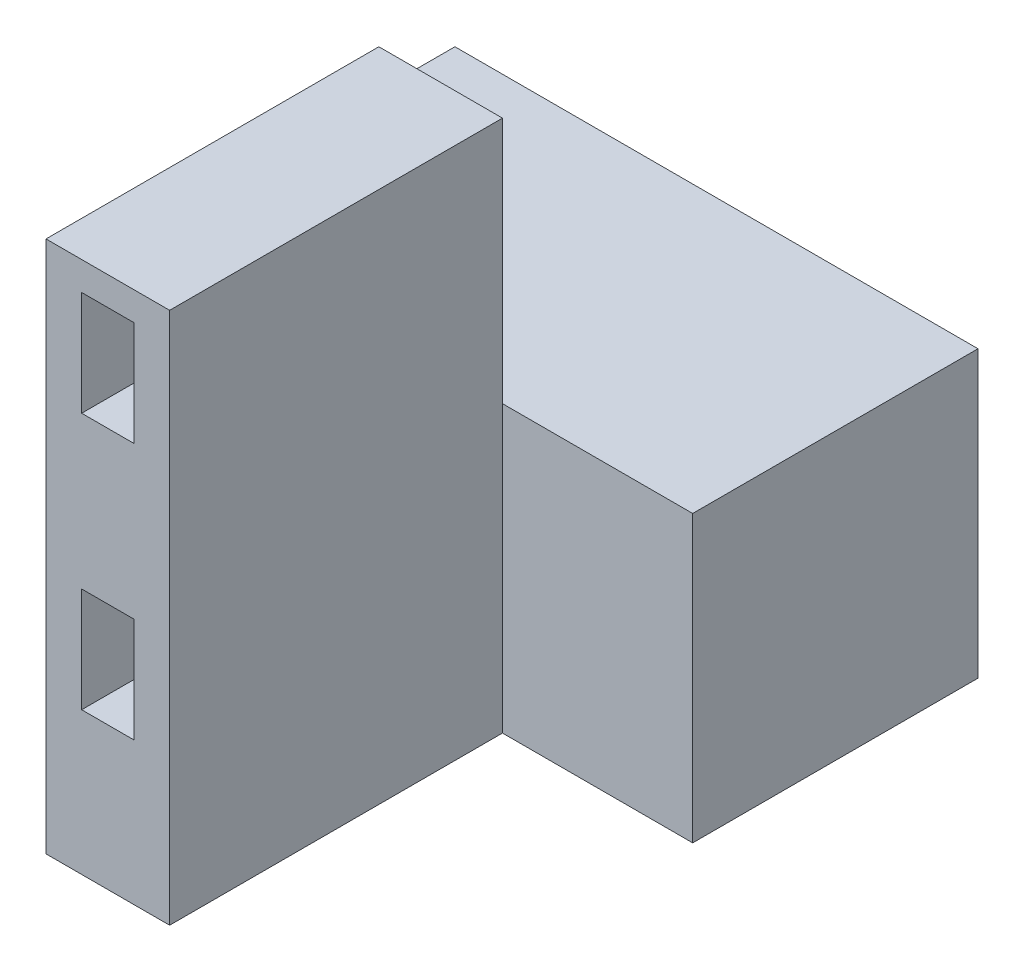
ISO-10303-21;
HEADER;
FILE_DESCRIPTION(('STEP AP214'),'2;1');
FILE_NAME('part.step','',(''),(''),'','','');
FILE_SCHEMA(('AUTOMOTIVE_DESIGN { 1 0 10303 214 1 1 1 1 }'));
ENDSEC;
DATA;
#1=APPLICATION_CONTEXT('core data for automotive mechanical design processes');
#2=APPLICATION_PROTOCOL_DEFINITION('international standard','automotive_design',2000,#1);
#3=PRODUCT_CONTEXT('',#1,'mechanical');
#4=PRODUCT('Part','Part','',(#3));
#5=PRODUCT_RELATED_PRODUCT_CATEGORY('part','',(#4));
#6=PRODUCT_DEFINITION_FORMATION('','',#4);
#7=PRODUCT_DEFINITION_CONTEXT('part definition',#1,'design');
#8=PRODUCT_DEFINITION('design','',#6,#7);
#9=PRODUCT_DEFINITION_SHAPE('','',#8);
#10=(LENGTH_UNIT() NAMED_UNIT(*) SI_UNIT(.MILLI.,.METRE.));
#11=(NAMED_UNIT(*) PLANE_ANGLE_UNIT() SI_UNIT($,.RADIAN.));
#12=(NAMED_UNIT(*) SI_UNIT($,.STERADIAN.) SOLID_ANGLE_UNIT());
#13=UNCERTAINTY_MEASURE_WITH_UNIT(LENGTH_MEASURE(1.E-05),#10,'distance_accuracy_value','');
#14=(GEOMETRIC_REPRESENTATION_CONTEXT(3) GLOBAL_UNCERTAINTY_ASSIGNED_CONTEXT((#13)) GLOBAL_UNIT_ASSIGNED_CONTEXT((#10,
#11,#12)) REPRESENTATION_CONTEXT('',''));
#15=CARTESIAN_POINT('',(0.,0.,0.));
#16=DIRECTION('',(0.,0.,1.));
#17=DIRECTION('',(1.,0.,0.));
#18=AXIS2_PLACEMENT_3D('',#15,#16,#17);
#19=CARTESIAN_POINT('',(27.5,30.,15.));
#20=DIRECTION('',(0.,0.,-1.));
#21=DIRECTION('',(-1.,0.,0.));
#22=AXIS2_PLACEMENT_3D('',#19,#20,#21);
#23=PLANE('',#22);
#24=DIRECTION('',(0.,1.,0.));
#25=VECTOR('',#24,1.);
#26=CARTESIAN_POINT('',(7.5,56.,15.));
#27=LINE('',#26,#25);
#28=CARTESIAN_POINT('',(7.5,0.,15.));
#29=VERTEX_POINT('',#28);
#30=CARTESIAN_POINT('',(7.5,30.,15.));
#31=VERTEX_POINT('',#30);
#32=EDGE_CURVE('E272',#29,#31,#27,.T.);
#33=ORIENTED_EDGE('',*,*,#32,.F.);
#34=DIRECTION('',(1.,0.,0.));
#35=VECTOR('',#34,1.);
#36=CARTESIAN_POINT('',(27.5,0.,15.));
#37=LINE('',#36,#35);
#38=CARTESIAN_POINT('',(27.5,0.,15.));
#39=VERTEX_POINT('',#38);
#40=EDGE_CURVE('E318',#29,#39,#37,.T.);
#41=ORIENTED_EDGE('',*,*,#40,.T.);
#42=DIRECTION('',(0.,-1.,0.));
#43=VECTOR('',#42,1.);
#44=CARTESIAN_POINT('',(27.5,30.,15.));
#45=LINE('',#44,#43);
#46=CARTESIAN_POINT('',(27.5,30.,15.));
#47=VERTEX_POINT('',#46);
#48=EDGE_CURVE('E333',#47,#39,#45,.T.);
#49=ORIENTED_EDGE('',*,*,#48,.F.);
#50=DIRECTION('',(1.,0.,0.));
#51=VECTOR('',#50,1.);
#52=CARTESIAN_POINT('',(27.5,30.,15.));
#53=LINE('',#52,#51);
#54=EDGE_CURVE('E301',#31,#47,#53,.T.);
#55=ORIENTED_EDGE('',*,*,#54,.F.);
#56=EDGE_LOOP('',(#33,#41,#49,#55));
#57=FACE_BOUND('',#56,.T.);
#58=ADVANCED_FACE('F43',(#57),#23,.F.);
#59=DIRECTION('',(0.,-1.,0.));
#60=VECTOR('',#59,1.);
#61=CARTESIAN_POINT('',(-5.5,56.,15.));
#62=LINE('',#61,#60);
#63=CARTESIAN_POINT('',(-5.5,30.,15.));
#64=VERTEX_POINT('',#63);
#65=CARTESIAN_POINT('',(-5.5,0.,15.));
#66=VERTEX_POINT('',#65);
#67=EDGE_CURVE('E11',#64,#66,#62,.T.);
#68=ORIENTED_EDGE('',*,*,#67,.F.);
#69=CARTESIAN_POINT('',(-27.5,30.,15.));
#70=VERTEX_POINT('',#69);
#71=EDGE_CURVE('E303',#70,#64,#53,.T.);
#72=ORIENTED_EDGE('',*,*,#71,.F.);
#73=DIRECTION('',(0.,-1.,0.));
#74=VECTOR('',#73,1.);
#75=CARTESIAN_POINT('',(-27.5,30.,15.));
#76=LINE('',#75,#74);
#77=CARTESIAN_POINT('',(-27.5,0.,15.));
#78=VERTEX_POINT('',#77);
#79=EDGE_CURVE('E47',#70,#78,#76,.T.);
#80=ORIENTED_EDGE('',*,*,#79,.T.);
#81=EDGE_CURVE('E319',#78,#66,#37,.T.);
#82=ORIENTED_EDGE('',*,*,#81,.T.);
#83=EDGE_LOOP('',(#68,#72,#80,#82));
#84=FACE_BOUND('',#83,.T.);
#85=ADVANCED_FACE('F344',(#84),#23,.F.);
#86=CARTESIAN_POINT('',(-27.5,30.,-15.));
#87=DIRECTION('',(1.,0.,0.));
#88=DIRECTION('',(0.,0.,-1.));
#89=AXIS2_PLACEMENT_3D('',#86,#87,#88);
#90=PLANE('',#89);
#91=DIRECTION('',(0.,0.,1.));
#92=VECTOR('',#91,1.);
#93=CARTESIAN_POINT('',(-27.5,0.,-15.));
#94=LINE('',#93,#92);
#95=CARTESIAN_POINT('',(-27.5,0.,-15.));
#96=VERTEX_POINT('',#95);
#97=EDGE_CURVE('E296',#96,#78,#94,.T.);
#98=ORIENTED_EDGE('',*,*,#97,.T.);
#99=ORIENTED_EDGE('',*,*,#79,.F.);
#100=DIRECTION('',(0.,0.,1.));
#101=VECTOR('',#100,1.);
#102=CARTESIAN_POINT('',(-27.5,30.,-15.));
#103=LINE('',#102,#101);
#104=CARTESIAN_POINT('',(-27.5,30.,-15.));
#105=VERTEX_POINT('',#104);
#106=EDGE_CURVE('E297',#105,#70,#103,.T.);
#107=ORIENTED_EDGE('',*,*,#106,.F.);
#108=DIRECTION('',(0.,-1.,0.));
#109=VECTOR('',#108,1.);
#110=CARTESIAN_POINT('',(-27.5,30.,-15.));
#111=LINE('',#110,#109);
#112=EDGE_CURVE('E314',#105,#96,#111,.T.);
#113=ORIENTED_EDGE('',*,*,#112,.T.);
#114=EDGE_LOOP('',(#98,#99,#107,#113));
#115=FACE_BOUND('',#114,.T.);
#116=ADVANCED_FACE('F45',(#115),#90,.F.);
#117=CARTESIAN_POINT('',(27.5,30.,-15.));
#118=DIRECTION('',(-1.,0.,0.));
#119=DIRECTION('',(0.,0.,1.));
#120=AXIS2_PLACEMENT_3D('',#117,#118,#119);
#121=PLANE('',#120);
#122=DIRECTION('',(0.,0.,-1.));
#123=VECTOR('',#122,1.);
#124=CARTESIAN_POINT('',(27.5,0.,-15.));
#125=LINE('',#124,#123);
#126=CARTESIAN_POINT('',(27.5,0.,-15.));
#127=VERTEX_POINT('',#126);
#128=EDGE_CURVE('E322',#39,#127,#125,.T.);
#129=ORIENTED_EDGE('',*,*,#128,.T.);
#130=DIRECTION('',(0.,-1.,0.));
#131=VECTOR('',#130,1.);
#132=CARTESIAN_POINT('',(27.5,30.,-15.));
#133=LINE('',#132,#131);
#134=CARTESIAN_POINT('',(27.5,30.,-15.));
#135=VERTEX_POINT('',#134);
#136=EDGE_CURVE('E330',#135,#127,#133,.T.);
#137=ORIENTED_EDGE('',*,*,#136,.F.);
#138=DIRECTION('',(0.,0.,-1.));
#139=VECTOR('',#138,1.);
#140=CARTESIAN_POINT('',(27.5,30.,-15.));
#141=LINE('',#140,#139);
#142=EDGE_CURVE('E307',#47,#135,#141,.T.);
#143=ORIENTED_EDGE('',*,*,#142,.F.);
#144=ORIENTED_EDGE('',*,*,#48,.T.);
#145=EDGE_LOOP('',(#129,#137,#143,#144));
#146=FACE_BOUND('',#145,.T.);
#147=ADVANCED_FACE('F372',(#146),#121,.F.);
#148=CARTESIAN_POINT('',(27.5,30.,-15.));
#149=DIRECTION('',(0.,0.,1.));
#150=DIRECTION('',(1.,0.,0.));
#151=AXIS2_PLACEMENT_3D('',#148,#149,#150);
#152=PLANE('',#151);
#153=DIRECTION('',(-1.,0.,0.));
#154=VECTOR('',#153,1.);
#155=CARTESIAN_POINT('',(27.5,0.,-15.));
#156=LINE('',#155,#154);
#157=EDGE_CURVE('E302',#127,#96,#156,.T.);
#158=ORIENTED_EDGE('',*,*,#157,.T.);
#159=ORIENTED_EDGE('',*,*,#112,.F.);
#160=DIRECTION('',(-1.,0.,0.));
#161=VECTOR('',#160,1.);
#162=CARTESIAN_POINT('',(27.5,30.,-15.));
#163=LINE('',#162,#161);
#164=EDGE_CURVE('E311',#135,#105,#163,.T.);
#165=ORIENTED_EDGE('',*,*,#164,.F.);
#166=ORIENTED_EDGE('',*,*,#136,.T.);
#167=EDGE_LOOP('',(#158,#159,#165,#166));
#168=FACE_BOUND('',#167,.T.);
#169=ADVANCED_FACE('F375',(#168),#152,.F.);
#170=CARTESIAN_POINT('',(0.,30.,0.));
#171=DIRECTION('',(0.,-1.,0.));
#172=DIRECTION('',(0.,0.,-1.));
#173=AXIS2_PLACEMENT_3D('',#170,#171,#172);
#174=PLANE('',#173);
#175=ORIENTED_EDGE('',*,*,#106,.T.);
#176=ORIENTED_EDGE('',*,*,#71,.T.);
#177=EDGE_CURVE('E308',#64,#31,#53,.T.);
#178=ORIENTED_EDGE('',*,*,#177,.T.);
#179=ORIENTED_EDGE('',*,*,#54,.T.);
#180=ORIENTED_EDGE('',*,*,#142,.T.);
#181=ORIENTED_EDGE('',*,*,#164,.T.);
#182=EDGE_LOOP('',(#175,#176,#178,#179,#180,#181));
#183=FACE_BOUND('',#182,.T.);
#184=ADVANCED_FACE('F362',(#183),#174,.F.);
#185=CARTESIAN_POINT('',(0.,0.,0.));
#186=DIRECTION('',(0.,-1.,0.));
#187=DIRECTION('',(0.,0.,-1.));
#188=AXIS2_PLACEMENT_3D('',#185,#186,#187);
#189=PLANE('',#188);
#190=ORIENTED_EDGE('',*,*,#97,.F.);
#191=ORIENTED_EDGE('',*,*,#157,.F.);
#192=ORIENTED_EDGE('',*,*,#128,.F.);
#193=ORIENTED_EDGE('',*,*,#40,.F.);
#194=DIRECTION('',(0.,0.,-1.));
#195=VECTOR('',#194,1.);
#196=CARTESIAN_POINT('',(7.50000000000001,0.,50.));
#197=LINE('',#196,#195);
#198=CARTESIAN_POINT('',(7.50000000000001,0.,50.));
#199=VERTEX_POINT('',#198);
#200=EDGE_CURVE('E271',#199,#29,#197,.T.);
#201=ORIENTED_EDGE('',*,*,#200,.F.);
#202=DIRECTION('',(1.,0.,0.));
#203=VECTOR('',#202,1.);
#204=CARTESIAN_POINT('',(-5.5,0.,50.));
#205=LINE('',#204,#203);
#206=CARTESIAN_POINT('',(-5.5,0.,50.));
#207=VERTEX_POINT('',#206);
#208=EDGE_CURVE('E268',#207,#199,#205,.T.);
#209=ORIENTED_EDGE('',*,*,#208,.F.);
#210=DIRECTION('',(0.,0.,-1.));
#211=VECTOR('',#210,1.);
#212=CARTESIAN_POINT('',(-5.5,0.,50.));
#213=LINE('',#212,#211);
#214=EDGE_CURVE('E284',#207,#66,#213,.T.);
#215=ORIENTED_EDGE('',*,*,#214,.T.);
#216=ORIENTED_EDGE('',*,*,#81,.F.);
#217=EDGE_LOOP('',(#190,#191,#192,#193,#201,#209,#215,#216));
#218=FACE_BOUND('',#217,.T.);
#219=ADVANCED_FACE('F351',(#218),#189,.T.);
#220=CARTESIAN_POINT('',(7.5,56.,50.));
#221=DIRECTION('',(-1.,0.,0.));
#222=DIRECTION('',(0.,-1.,0.));
#223=AXIS2_PLACEMENT_3D('',#220,#221,#222);
#224=PLANE('',#223);
#225=ORIENTED_EDGE('',*,*,#32,.T.);
#226=CARTESIAN_POINT('',(7.5,56.,15.));
#227=VERTEX_POINT('',#226);
#228=EDGE_CURVE('E210',#31,#227,#27,.T.);
#229=ORIENTED_EDGE('',*,*,#228,.T.);
#230=DIRECTION('',(0.,0.,-1.));
#231=VECTOR('',#230,1.);
#232=CARTESIAN_POINT('',(7.5,56.,50.));
#233=LINE('',#232,#231);
#234=CARTESIAN_POINT('',(7.5,56.,50.));
#235=VERTEX_POINT('',#234);
#236=EDGE_CURVE('E292',#235,#227,#233,.T.);
#237=ORIENTED_EDGE('',*,*,#236,.F.);
#238=DIRECTION('',(0.,1.,0.));
#239=VECTOR('',#238,1.);
#240=CARTESIAN_POINT('',(7.5,56.,50.));
#241=LINE('',#240,#239);
#242=EDGE_CURVE('E258',#199,#235,#241,.T.);
#243=ORIENTED_EDGE('',*,*,#242,.F.);
#244=ORIENTED_EDGE('',*,*,#200,.T.);
#245=EDGE_LOOP('',(#225,#229,#237,#243,#244));
#246=FACE_BOUND('',#245,.T.);
#247=ADVANCED_FACE('F424',(#246),#224,.F.);
#248=CARTESIAN_POINT('',(7.5,56.,50.));
#249=DIRECTION('',(0.,-1.,0.));
#250=DIRECTION('',(0.,0.,-1.));
#251=AXIS2_PLACEMENT_3D('',#248,#249,#250);
#252=PLANE('',#251);
#253=DIRECTION('',(-1.,0.,0.));
#254=VECTOR('',#253,1.);
#255=CARTESIAN_POINT('',(7.5,56.,15.));
#256=LINE('',#255,#254);
#257=CARTESIAN_POINT('',(-5.5,56.,15.));
#258=VERTEX_POINT('',#257);
#259=EDGE_CURVE('E276',#227,#258,#256,.T.);
#260=ORIENTED_EDGE('',*,*,#259,.T.);
#261=DIRECTION('',(0.,0.,-1.));
#262=VECTOR('',#261,1.);
#263=CARTESIAN_POINT('',(-5.5,56.,50.));
#264=LINE('',#263,#262);
#265=CARTESIAN_POINT('',(-5.5,56.,50.));
#266=VERTEX_POINT('',#265);
#267=EDGE_CURVE('E288',#266,#258,#264,.T.);
#268=ORIENTED_EDGE('',*,*,#267,.F.);
#269=DIRECTION('',(-1.,0.,0.));
#270=VECTOR('',#269,1.);
#271=CARTESIAN_POINT('',(7.5,56.,50.));
#272=LINE('',#271,#270);
#273=EDGE_CURVE('E262',#235,#266,#272,.T.);
#274=ORIENTED_EDGE('',*,*,#273,.F.);
#275=ORIENTED_EDGE('',*,*,#236,.T.);
#276=EDGE_LOOP('',(#260,#268,#274,#275));
#277=FACE_BOUND('',#276,.T.);
#278=ADVANCED_FACE('F444',(#277),#252,.F.);
#279=CARTESIAN_POINT('',(-5.5,56.,50.));
#280=DIRECTION('',(1.,0.,0.));
#281=DIRECTION('',(0.,1.,0.));
#282=AXIS2_PLACEMENT_3D('',#279,#280,#281);
#283=PLANE('',#282);
#284=EDGE_CURVE('E54',#258,#64,#62,.T.);
#285=ORIENTED_EDGE('',*,*,#284,.T.);
#286=ORIENTED_EDGE('',*,*,#67,.T.);
#287=ORIENTED_EDGE('',*,*,#214,.F.);
#288=DIRECTION('',(0.,-1.,0.));
#289=VECTOR('',#288,1.);
#290=CARTESIAN_POINT('',(-5.5,56.,50.));
#291=LINE('',#290,#289);
#292=EDGE_CURVE('E265',#266,#207,#291,.T.);
#293=ORIENTED_EDGE('',*,*,#292,.F.);
#294=ORIENTED_EDGE('',*,*,#267,.T.);
#295=EDGE_LOOP('',(#285,#286,#287,#293,#294));
#296=FACE_BOUND('',#295,.T.);
#297=ADVANCED_FACE('F357',(#296),#283,.F.);
#298=CARTESIAN_POINT('',(0.,0.,50.));
#299=DIRECTION('',(0.,0.,1.));
#300=DIRECTION('',(1.,0.,0.));
#301=AXIS2_PLACEMENT_3D('',#298,#299,#300);
#302=PLANE('',#301);
#303=DIRECTION('',(0.,-1.,0.));
#304=VECTOR('',#303,1.);
#305=CARTESIAN_POINT('',(-1.75,26.,50.));
#306=LINE('',#305,#304);
#307=CARTESIAN_POINT('',(-1.75,26.,50.));
#308=VERTEX_POINT('',#307);
#309=CARTESIAN_POINT('',(-1.75,15.,50.));
#310=VERTEX_POINT('',#309);
#311=EDGE_CURVE('E61',#308,#310,#306,.T.);
#312=ORIENTED_EDGE('',*,*,#311,.F.);
#313=DIRECTION('',(-1.,0.,0.));
#314=VECTOR('',#313,1.);
#315=CARTESIAN_POINT('',(3.75,26.,50.));
#316=LINE('',#315,#314);
#317=CARTESIAN_POINT('',(3.75,26.,50.));
#318=VERTEX_POINT('',#317);
#319=EDGE_CURVE('E188',#318,#308,#316,.T.);
#320=ORIENTED_EDGE('',*,*,#319,.F.);
#321=DIRECTION('',(0.,1.,0.));
#322=VECTOR('',#321,1.);
#323=CARTESIAN_POINT('',(3.75,26.,50.));
#324=LINE('',#323,#322);
#325=CARTESIAN_POINT('',(3.75,15.,50.));
#326=VERTEX_POINT('',#325);
#327=EDGE_CURVE('E192',#326,#318,#324,.T.);
#328=ORIENTED_EDGE('',*,*,#327,.F.);
#329=DIRECTION('',(1.,0.,0.));
#330=VECTOR('',#329,1.);
#331=CARTESIAN_POINT('',(3.75,15.,50.));
#332=LINE('',#331,#330);
#333=EDGE_CURVE('E201',#310,#326,#332,.T.);
#334=ORIENTED_EDGE('',*,*,#333,.F.);
#335=EDGE_LOOP('',(#312,#320,#328,#334));
#336=FACE_BOUND('',#335,.T.);
#337=DIRECTION('',(0.,-1.,0.));
#338=VECTOR('',#337,1.);
#339=CARTESIAN_POINT('',(-1.75,53.,50.));
#340=LINE('',#339,#338);
#341=CARTESIAN_POINT('',(-1.75,53.,50.));
#342=VERTEX_POINT('',#341);
#343=CARTESIAN_POINT('',(-1.75,42.,50.));
#344=VERTEX_POINT('',#343);
#345=EDGE_CURVE('E69',#342,#344,#340,.T.);
#346=ORIENTED_EDGE('',*,*,#345,.F.);
#347=DIRECTION('',(-1.,0.,0.));
#348=VECTOR('',#347,1.);
#349=CARTESIAN_POINT('',(3.75,53.,50.));
#350=LINE('',#349,#348);
#351=CARTESIAN_POINT('',(3.75,53.,50.));
#352=VERTEX_POINT('',#351);
#353=EDGE_CURVE('E229',#352,#342,#350,.T.);
#354=ORIENTED_EDGE('',*,*,#353,.F.);
#355=DIRECTION('',(0.,1.,0.));
#356=VECTOR('',#355,1.);
#357=CARTESIAN_POINT('',(3.75,53.,50.));
#358=LINE('',#357,#356);
#359=CARTESIAN_POINT('',(3.75,42.,50.));
#360=VERTEX_POINT('',#359);
#361=EDGE_CURVE('E233',#360,#352,#358,.T.);
#362=ORIENTED_EDGE('',*,*,#361,.F.);
#363=DIRECTION('',(1.,0.,0.));
#364=VECTOR('',#363,1.);
#365=CARTESIAN_POINT('',(3.75,42.,50.));
#366=LINE('',#365,#364);
#367=EDGE_CURVE('E238',#344,#360,#366,.T.);
#368=ORIENTED_EDGE('',*,*,#367,.F.);
#369=EDGE_LOOP('',(#346,#354,#362,#368));
#370=FACE_BOUND('',#369,.T.);
#371=ORIENTED_EDGE('',*,*,#242,.T.);
#372=ORIENTED_EDGE('',*,*,#273,.T.);
#373=ORIENTED_EDGE('',*,*,#292,.T.);
#374=ORIENTED_EDGE('',*,*,#208,.T.);
#375=EDGE_LOOP('',(#371,#372,#373,#374));
#376=FACE_BOUND('',#375,.T.);
#377=ADVANCED_FACE('F463',(#336,#370,#376),#302,.T.);
#378=CARTESIAN_POINT('',(0.,0.,15.));
#379=DIRECTION('',(0.,0.,1.));
#380=DIRECTION('',(1.,0.,0.));
#381=AXIS2_PLACEMENT_3D('',#378,#379,#380);
#382=PLANE('',#381);
#383=ORIENTED_EDGE('',*,*,#177,.F.);
#384=ORIENTED_EDGE('',*,*,#284,.F.);
#385=ORIENTED_EDGE('',*,*,#259,.F.);
#386=ORIENTED_EDGE('',*,*,#228,.F.);
#387=EDGE_LOOP('',(#383,#384,#385,#386));
#388=FACE_BOUND('',#387,.T.);
#389=ADVANCED_FACE('F365',(#388),#382,.F.);
#390=CARTESIAN_POINT('',(-1.75,53.,28.));
#391=DIRECTION('',(-1.,0.,0.));
#392=DIRECTION('',(0.,-1.,0.));
#393=AXIS2_PLACEMENT_3D('',#390,#391,#392);
#394=PLANE('',#393);
#395=ORIENTED_EDGE('',*,*,#345,.T.);
#396=DIRECTION('',(0.,0.,1.));
#397=VECTOR('',#396,1.);
#398=CARTESIAN_POINT('',(-1.75,42.,28.));
#399=LINE('',#398,#397);
#400=CARTESIAN_POINT('',(-1.75,42.,28.));
#401=VERTEX_POINT('',#400);
#402=EDGE_CURVE('E216',#401,#344,#399,.T.);
#403=ORIENTED_EDGE('',*,*,#402,.F.);
#404=DIRECTION('',(0.,-1.,0.));
#405=VECTOR('',#404,1.);
#406=CARTESIAN_POINT('',(-1.75,53.,28.));
#407=LINE('',#406,#405);
#408=CARTESIAN_POINT('',(-1.75,53.,28.));
#409=VERTEX_POINT('',#408);
#410=EDGE_CURVE('E234',#409,#401,#407,.T.);
#411=ORIENTED_EDGE('',*,*,#410,.F.);
#412=DIRECTION('',(0.,0.,1.));
#413=VECTOR('',#412,1.);
#414=CARTESIAN_POINT('',(-1.75,53.,28.));
#415=LINE('',#414,#413);
#416=EDGE_CURVE('E226',#409,#342,#415,.T.);
#417=ORIENTED_EDGE('',*,*,#416,.T.);
#418=EDGE_LOOP('',(#395,#403,#411,#417));
#419=FACE_BOUND('',#418,.T.);
#420=ADVANCED_FACE('F481',(#419),#394,.F.);
#421=CARTESIAN_POINT('',(3.75,53.,28.));
#422=DIRECTION('',(0.,1.,0.));
#423=DIRECTION('',(0.,0.,1.));
#424=AXIS2_PLACEMENT_3D('',#421,#422,#423);
#425=PLANE('',#424);
#426=ORIENTED_EDGE('',*,*,#353,.T.);
#427=ORIENTED_EDGE('',*,*,#416,.F.);
#428=DIRECTION('',(-1.,0.,0.));
#429=VECTOR('',#428,1.);
#430=CARTESIAN_POINT('',(3.75,53.,28.));
#431=LINE('',#430,#429);
#432=CARTESIAN_POINT('',(3.75,53.,28.));
#433=VERTEX_POINT('',#432);
#434=EDGE_CURVE('E219',#433,#409,#431,.T.);
#435=ORIENTED_EDGE('',*,*,#434,.F.);
#436=DIRECTION('',(0.,0.,1.));
#437=VECTOR('',#436,1.);
#438=CARTESIAN_POINT('',(3.75,53.,28.));
#439=LINE('',#438,#437);
#440=EDGE_CURVE('E223',#433,#352,#439,.T.);
#441=ORIENTED_EDGE('',*,*,#440,.T.);
#442=EDGE_LOOP('',(#426,#427,#435,#441));
#443=FACE_BOUND('',#442,.T.);
#444=ADVANCED_FACE('F490',(#443),#425,.F.);
#445=CARTESIAN_POINT('',(3.75,53.,28.));
#446=DIRECTION('',(1.,0.,0.));
#447=DIRECTION('',(0.,1.,0.));
#448=AXIS2_PLACEMENT_3D('',#445,#446,#447);
#449=PLANE('',#448);
#450=ORIENTED_EDGE('',*,*,#361,.T.);
#451=ORIENTED_EDGE('',*,*,#440,.F.);
#452=DIRECTION('',(0.,1.,0.));
#453=VECTOR('',#452,1.);
#454=CARTESIAN_POINT('',(3.75,53.,28.));
#455=LINE('',#454,#453);
#456=CARTESIAN_POINT('',(3.75,42.,28.));
#457=VERTEX_POINT('',#456);
#458=EDGE_CURVE('E247',#457,#433,#455,.T.);
#459=ORIENTED_EDGE('',*,*,#458,.F.);
#460=DIRECTION('',(0.,0.,1.));
#461=VECTOR('',#460,1.);
#462=CARTESIAN_POINT('',(3.75,42.,28.));
#463=LINE('',#462,#461);
#464=EDGE_CURVE('E220',#457,#360,#463,.T.);
#465=ORIENTED_EDGE('',*,*,#464,.T.);
#466=EDGE_LOOP('',(#450,#451,#459,#465));
#467=FACE_BOUND('',#466,.T.);
#468=ADVANCED_FACE('F499',(#467),#449,.F.);
#469=CARTESIAN_POINT('',(3.75,42.,28.));
#470=DIRECTION('',(0.,-1.,0.));
#471=DIRECTION('',(0.,0.,-1.));
#472=AXIS2_PLACEMENT_3D('',#469,#470,#471);
#473=PLANE('',#472);
#474=ORIENTED_EDGE('',*,*,#367,.T.);
#475=ORIENTED_EDGE('',*,*,#464,.F.);
#476=DIRECTION('',(1.,0.,0.));
#477=VECTOR('',#476,1.);
#478=CARTESIAN_POINT('',(3.75,42.,28.));
#479=LINE('',#478,#477);
#480=EDGE_CURVE('E251',#401,#457,#479,.T.);
#481=ORIENTED_EDGE('',*,*,#480,.F.);
#482=ORIENTED_EDGE('',*,*,#402,.T.);
#483=EDGE_LOOP('',(#474,#475,#481,#482));
#484=FACE_BOUND('',#483,.T.);
#485=ADVANCED_FACE('F509',(#484),#473,.F.);
#486=CARTESIAN_POINT('',(0.,0.,28.));
#487=DIRECTION('',(0.,0.,-1.));
#488=DIRECTION('',(-1.,0.,0.));
#489=AXIS2_PLACEMENT_3D('',#486,#487,#488);
#490=PLANE('',#489);
#491=ORIENTED_EDGE('',*,*,#410,.T.);
#492=ORIENTED_EDGE('',*,*,#480,.T.);
#493=ORIENTED_EDGE('',*,*,#458,.T.);
#494=ORIENTED_EDGE('',*,*,#434,.T.);
#495=EDGE_LOOP('',(#491,#492,#493,#494));
#496=FACE_BOUND('',#495,.T.);
#497=ADVANCED_FACE('F519',(#496),#490,.F.);
#498=CARTESIAN_POINT('',(-1.75,26.,28.));
#499=DIRECTION('',(-1.,0.,0.));
#500=DIRECTION('',(0.,-1.,0.));
#501=AXIS2_PLACEMENT_3D('',#498,#499,#500);
#502=PLANE('',#501);
#503=ORIENTED_EDGE('',*,*,#311,.T.);
#504=DIRECTION('',(0.,0.,1.));
#505=VECTOR('',#504,1.);
#506=CARTESIAN_POINT('',(-1.75,15.,28.));
#507=LINE('',#506,#505);
#508=CARTESIAN_POINT('',(-1.75,15.,28.));
#509=VERTEX_POINT('',#508);
#510=EDGE_CURVE('E163',#509,#310,#507,.T.);
#511=ORIENTED_EDGE('',*,*,#510,.F.);
#512=DIRECTION('',(0.,-1.,0.));
#513=VECTOR('',#512,1.);
#514=CARTESIAN_POINT('',(-1.75,26.,28.));
#515=LINE('',#514,#513);
#516=CARTESIAN_POINT('',(-1.75,26.,28.));
#517=VERTEX_POINT('',#516);
#518=EDGE_CURVE('E167',#517,#509,#515,.T.);
#519=ORIENTED_EDGE('',*,*,#518,.F.);
#520=DIRECTION('',(0.,0.,1.));
#521=VECTOR('',#520,1.);
#522=CARTESIAN_POINT('',(-1.75,26.,28.));
#523=LINE('',#522,#521);
#524=EDGE_CURVE('E207',#517,#308,#523,.T.);
#525=ORIENTED_EDGE('',*,*,#524,.T.);
#526=EDGE_LOOP('',(#503,#511,#519,#525));
#527=FACE_BOUND('',#526,.T.);
#528=ADVANCED_FACE('F165',(#527),#502,.F.);
#529=CARTESIAN_POINT('',(3.75,26.,28.));
#530=DIRECTION('',(0.,1.,0.));
#531=DIRECTION('',(0.,0.,1.));
#532=AXIS2_PLACEMENT_3D('',#529,#530,#531);
#533=PLANE('',#532);
#534=ORIENTED_EDGE('',*,*,#319,.T.);
#535=ORIENTED_EDGE('',*,*,#524,.F.);
#536=DIRECTION('',(-1.,0.,0.));
#537=VECTOR('',#536,1.);
#538=CARTESIAN_POINT('',(3.75,26.,28.));
#539=LINE('',#538,#537);
#540=CARTESIAN_POINT('',(3.75,26.,28.));
#541=VERTEX_POINT('',#540);
#542=EDGE_CURVE('E174',#541,#517,#539,.T.);
#543=ORIENTED_EDGE('',*,*,#542,.F.);
#544=DIRECTION('',(0.,0.,1.));
#545=VECTOR('',#544,1.);
#546=CARTESIAN_POINT('',(3.75,26.,28.));
#547=LINE('',#546,#545);
#548=EDGE_CURVE('E211',#541,#318,#547,.T.);
#549=ORIENTED_EDGE('',*,*,#548,.T.);
#550=EDGE_LOOP('',(#534,#535,#543,#549));
#551=FACE_BOUND('',#550,.T.);
#552=ADVANCED_FACE('F538',(#551),#533,.F.);
#553=CARTESIAN_POINT('',(3.75,26.,28.));
#554=DIRECTION('',(1.,0.,0.));
#555=DIRECTION('',(0.,1.,0.));
#556=AXIS2_PLACEMENT_3D('',#553,#554,#555);
#557=PLANE('',#556);
#558=ORIENTED_EDGE('',*,*,#327,.T.);
#559=ORIENTED_EDGE('',*,*,#548,.F.);
#560=DIRECTION('',(0.,1.,0.));
#561=VECTOR('',#560,1.);
#562=CARTESIAN_POINT('',(3.75,26.,28.));
#563=LINE('',#562,#561);
#564=CARTESIAN_POINT('',(3.75,15.,28.));
#565=VERTEX_POINT('',#564);
#566=EDGE_CURVE('E183',#565,#541,#563,.T.);
#567=ORIENTED_EDGE('',*,*,#566,.F.);
#568=DIRECTION('',(0.,0.,1.));
#569=VECTOR('',#568,1.);
#570=CARTESIAN_POINT('',(3.75,15.,28.));
#571=LINE('',#570,#569);
#572=EDGE_CURVE('E173',#565,#326,#571,.T.);
#573=ORIENTED_EDGE('',*,*,#572,.T.);
#574=EDGE_LOOP('',(#558,#559,#567,#573));
#575=FACE_BOUND('',#574,.T.);
#576=ADVANCED_FACE('F547',(#575),#557,.F.);
#577=CARTESIAN_POINT('',(3.75,15.,28.));
#578=DIRECTION('',(0.,-1.,0.));
#579=DIRECTION('',(0.,0.,-1.));
#580=AXIS2_PLACEMENT_3D('',#577,#578,#579);
#581=PLANE('',#580);
#582=ORIENTED_EDGE('',*,*,#333,.T.);
#583=ORIENTED_EDGE('',*,*,#572,.F.);
#584=DIRECTION('',(1.,0.,0.));
#585=VECTOR('',#584,1.);
#586=CARTESIAN_POINT('',(3.75,15.,28.));
#587=LINE('',#586,#585);
#588=EDGE_CURVE('E177',#509,#565,#587,.T.);
#589=ORIENTED_EDGE('',*,*,#588,.F.);
#590=ORIENTED_EDGE('',*,*,#510,.T.);
#591=EDGE_LOOP('',(#582,#583,#589,#590));
#592=FACE_BOUND('',#591,.T.);
#593=ADVANCED_FACE('F178',(#592),#581,.F.);
#594=CARTESIAN_POINT('',(0.,0.,28.));
#595=DIRECTION('',(0.,0.,-1.));
#596=DIRECTION('',(-1.,0.,0.));
#597=AXIS2_PLACEMENT_3D('',#594,#595,#596);
#598=PLANE('',#597);
#599=ORIENTED_EDGE('',*,*,#518,.T.);
#600=ORIENTED_EDGE('',*,*,#588,.T.);
#601=ORIENTED_EDGE('',*,*,#566,.T.);
#602=ORIENTED_EDGE('',*,*,#542,.T.);
#603=EDGE_LOOP('',(#599,#600,#601,#602));
#604=FACE_BOUND('',#603,.T.);
#605=ADVANCED_FACE('F185',(#604),#598,.F.);
#606=CLOSED_SHELL('',(#58,#85,#116,#147,#169,#184,#219,#247,#278,#297,#377,#389,#420,#444,#468,
#485,#497,#528,#552,#576,#593,#605));
#607=MANIFOLD_SOLID_BREP('B2',#606);
#608=ADVANCED_BREP_SHAPE_REPRESENTATION('',(#18,#607),#14);
#609=SHAPE_DEFINITION_REPRESENTATION(#9,#608);
ENDSEC;
END-ISO-10303-21;
